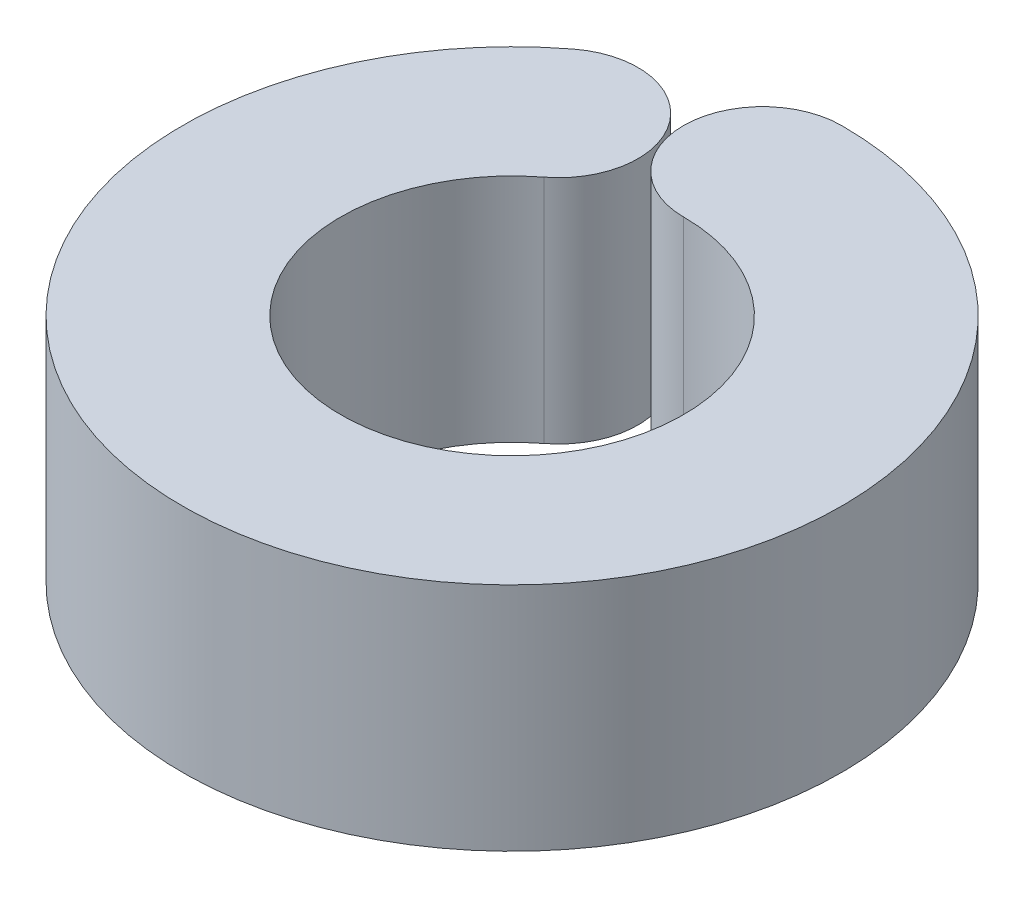
ISO-10303-21;
HEADER;
FILE_DESCRIPTION(('STEP AP214'),'2;1');
FILE_NAME('part.step','',(''),(''),'','','');
FILE_SCHEMA(('AUTOMOTIVE_DESIGN { 1 0 10303 214 1 1 1 1 }'));
ENDSEC;
DATA;
#1=APPLICATION_CONTEXT('core data for automotive mechanical design processes');
#2=APPLICATION_PROTOCOL_DEFINITION('international standard','automotive_design',2000,#1);
#3=PRODUCT_CONTEXT('',#1,'mechanical');
#4=PRODUCT('Part','Part','',(#3));
#5=PRODUCT_RELATED_PRODUCT_CATEGORY('part','',(#4));
#6=PRODUCT_DEFINITION_FORMATION('','',#4);
#7=PRODUCT_DEFINITION_CONTEXT('part definition',#1,'design');
#8=PRODUCT_DEFINITION('design','',#6,#7);
#9=PRODUCT_DEFINITION_SHAPE('','',#8);
#10=(LENGTH_UNIT() NAMED_UNIT(*) SI_UNIT(.MILLI.,.METRE.));
#11=(NAMED_UNIT(*) PLANE_ANGLE_UNIT() SI_UNIT($,.RADIAN.));
#12=(NAMED_UNIT(*) SI_UNIT($,.STERADIAN.) SOLID_ANGLE_UNIT());
#13=UNCERTAINTY_MEASURE_WITH_UNIT(LENGTH_MEASURE(1.E-05),#10,'distance_accuracy_value','');
#14=(GEOMETRIC_REPRESENTATION_CONTEXT(3) GLOBAL_UNCERTAINTY_ASSIGNED_CONTEXT((#13)) GLOBAL_UNIT_ASSIGNED_CONTEXT((#10,
#11,#12)) REPRESENTATION_CONTEXT('',''));
#15=CARTESIAN_POINT('',(0.,0.,0.));
#16=DIRECTION('',(0.,0.,1.));
#17=DIRECTION('',(1.,0.,0.));
#18=AXIS2_PLACEMENT_3D('',#15,#16,#17);
#19=CARTESIAN_POINT('',(0.,3.5,0.));
#20=DIRECTION('',(0.,-1.,0.));
#21=DIRECTION('',(0.,0.,-1.));
#22=AXIS2_PLACEMENT_3D('',#19,#20,#21);
#23=CYLINDRICAL_SURFACE('',#22,2.6);
#24=CARTESIAN_POINT('',(0.,0.,0.));
#25=DIRECTION('',(0.,1.,0.));
#26=DIRECTION('',(0.,0.,1.));
#27=AXIS2_PLACEMENT_3D('',#24,#25,#26);
#28=CIRCLE('',#27,2.6);
#29=CARTESIAN_POINT('',(0.,0.,-2.6));
#30=VERTEX_POINT('',#29);
#31=CARTESIAN_POINT('',(-1.57975097216721,0.,-2.06503919234884));
#32=VERTEX_POINT('',#31);
#33=EDGE_CURVE('E109',#30,#32,#28,.F.);
#34=ORIENTED_EDGE('',*,*,#33,.T.);
#35=DIRECTION('',(0.,-1.,0.));
#36=VECTOR('',#35,1.);
#37=CARTESIAN_POINT('',(-1.57975097216721,3.5,-2.06503919234884));
#38=LINE('',#37,#36);
#39=CARTESIAN_POINT('',(-1.57975097216721,3.5,-2.06503919234884));
#40=VERTEX_POINT('',#39);
#41=EDGE_CURVE('E11',#40,#32,#38,.T.);
#42=ORIENTED_EDGE('',*,*,#41,.F.);
#43=CARTESIAN_POINT('',(0.,3.5,0.));
#44=DIRECTION('',(0.,1.,0.));
#45=DIRECTION('',(0.,0.,1.));
#46=AXIS2_PLACEMENT_3D('',#43,#44,#45);
#47=CIRCLE('',#46,2.6);
#48=CARTESIAN_POINT('',(0.,3.5,-2.6));
#49=VERTEX_POINT('',#48);
#50=EDGE_CURVE('E91',#49,#40,#47,.F.);
#51=ORIENTED_EDGE('',*,*,#50,.F.);
#52=DIRECTION('',(0.,-1.,0.));
#53=VECTOR('',#52,1.);
#54=CARTESIAN_POINT('',(0.,3.5,-2.6));
#55=LINE('',#54,#53);
#56=EDGE_CURVE('E58',#49,#30,#55,.T.);
#57=ORIENTED_EDGE('',*,*,#56,.T.);
#58=EDGE_LOOP('',(#34,#42,#51,#57));
#59=FACE_BOUND('',#58,.T.);
#60=ADVANCED_FACE('F41',(#59),#23,.F.);
#61=CARTESIAN_POINT('',(-2.30886680547515,3.5,-3.01813420420216));
#62=DIRECTION('',(0.,-1.,0.));
#63=DIRECTION('',(0.,0.,-1.));
#64=AXIS2_PLACEMENT_3D('',#61,#62,#63);
#65=CYLINDRICAL_SURFACE('',#64,1.2);
#66=CARTESIAN_POINT('',(-2.30886680547515,0.,-3.01813420420216));
#67=DIRECTION('',(0.,1.,0.));
#68=DIRECTION('',(0.,0.,1.));
#69=AXIS2_PLACEMENT_3D('',#66,#67,#68);
#70=CIRCLE('',#69,1.2);
#71=CARTESIAN_POINT('',(-3.03798263878309,0.,-3.97122921605547));
#72=VERTEX_POINT('',#71);
#73=EDGE_CURVE('E97',#32,#72,#70,.T.);
#74=ORIENTED_EDGE('',*,*,#73,.T.);
#75=DIRECTION('',(0.,-1.,0.));
#76=VECTOR('',#75,1.);
#77=CARTESIAN_POINT('',(-3.03798263878309,3.5,-3.97122921605547));
#78=LINE('',#77,#76);
#79=CARTESIAN_POINT('',(-3.03798263878309,3.5,-3.97122921605547));
#80=VERTEX_POINT('',#79);
#81=EDGE_CURVE('E50',#80,#72,#78,.T.);
#82=ORIENTED_EDGE('',*,*,#81,.F.);
#83=CARTESIAN_POINT('',(-2.30886680547515,3.5,-3.01813420420216));
#84=DIRECTION('',(0.,1.,0.));
#85=DIRECTION('',(0.,0.,1.));
#86=AXIS2_PLACEMENT_3D('',#83,#84,#85);
#87=CIRCLE('',#86,1.2);
#88=EDGE_CURVE('E83',#40,#80,#87,.T.);
#89=ORIENTED_EDGE('',*,*,#88,.F.);
#90=ORIENTED_EDGE('',*,*,#41,.T.);
#91=EDGE_LOOP('',(#74,#82,#89,#90));
#92=FACE_BOUND('',#91,.T.);
#93=ADVANCED_FACE('F96',(#92),#65,.T.);
#94=CARTESIAN_POINT('',(0.,3.5,0.));
#95=DIRECTION('',(0.,-1.,0.));
#96=DIRECTION('',(0.,0.,-1.));
#97=AXIS2_PLACEMENT_3D('',#94,#95,#96);
#98=CYLINDRICAL_SURFACE('',#97,5.);
#99=CARTESIAN_POINT('',(0.,0.,0.));
#100=DIRECTION('',(0.,1.,0.));
#101=DIRECTION('',(0.,0.,1.));
#102=AXIS2_PLACEMENT_3D('',#99,#100,#101);
#103=CIRCLE('',#102,5.);
#104=CARTESIAN_POINT('',(0.,0.,-5.));
#105=VERTEX_POINT('',#104);
#106=EDGE_CURVE('E114',#105,#72,#103,.F.);
#107=ORIENTED_EDGE('',*,*,#106,.F.);
#108=DIRECTION('',(0.,-1.,0.));
#109=VECTOR('',#108,1.);
#110=CARTESIAN_POINT('',(0.,3.5,-5.));
#111=LINE('',#110,#109);
#112=CARTESIAN_POINT('',(0.,3.5,-5.));
#113=VERTEX_POINT('',#112);
#114=EDGE_CURVE('E72',#113,#105,#111,.T.);
#115=ORIENTED_EDGE('',*,*,#114,.F.);
#116=CARTESIAN_POINT('',(0.,3.5,0.));
#117=DIRECTION('',(0.,1.,0.));
#118=DIRECTION('',(0.,0.,1.));
#119=AXIS2_PLACEMENT_3D('',#116,#117,#118);
#120=CIRCLE('',#119,5.);
#121=EDGE_CURVE('E90',#113,#80,#120,.F.);
#122=ORIENTED_EDGE('',*,*,#121,.T.);
#123=ORIENTED_EDGE('',*,*,#81,.T.);
#124=EDGE_LOOP('',(#107,#115,#122,#123));
#125=FACE_BOUND('',#124,.T.);
#126=ADVANCED_FACE('F101',(#125),#98,.T.);
#127=CARTESIAN_POINT('',(0.,3.5,-3.8));
#128=DIRECTION('',(0.,-1.,0.));
#129=DIRECTION('',(0.,0.,-1.));
#130=AXIS2_PLACEMENT_3D('',#127,#128,#129);
#131=CYLINDRICAL_SURFACE('',#130,1.2);
#132=CARTESIAN_POINT('',(0.,0.,-3.8));
#133=DIRECTION('',(0.,1.,0.));
#134=DIRECTION('',(0.,0.,1.));
#135=AXIS2_PLACEMENT_3D('',#132,#133,#134);
#136=CIRCLE('',#135,1.2);
#137=EDGE_CURVE('E117',#30,#105,#136,.F.);
#138=ORIENTED_EDGE('',*,*,#137,.F.);
#139=ORIENTED_EDGE('',*,*,#56,.F.);
#140=CARTESIAN_POINT('',(0.,3.5,-3.8));
#141=DIRECTION('',(0.,1.,0.));
#142=DIRECTION('',(0.,0.,1.));
#143=AXIS2_PLACEMENT_3D('',#140,#141,#142);
#144=CIRCLE('',#143,1.2);
#145=EDGE_CURVE('E103',#49,#113,#144,.F.);
#146=ORIENTED_EDGE('',*,*,#145,.T.);
#147=ORIENTED_EDGE('',*,*,#114,.T.);
#148=EDGE_LOOP('',(#138,#139,#146,#147));
#149=FACE_BOUND('',#148,.T.);
#150=ADVANCED_FACE('F127',(#149),#131,.T.);
#151=CARTESIAN_POINT('',(0.,3.5,0.));
#152=DIRECTION('',(0.,1.,0.));
#153=DIRECTION('',(0.,0.,1.));
#154=AXIS2_PLACEMENT_3D('',#151,#152,#153);
#155=PLANE('',#154);
#156=ORIENTED_EDGE('',*,*,#50,.T.);
#157=ORIENTED_EDGE('',*,*,#88,.T.);
#158=ORIENTED_EDGE('',*,*,#121,.F.);
#159=ORIENTED_EDGE('',*,*,#145,.F.);
#160=EDGE_LOOP('',(#156,#157,#158,#159));
#161=FACE_BOUND('',#160,.T.);
#162=ADVANCED_FACE('F87',(#161),#155,.T.);
#163=CARTESIAN_POINT('',(0.,0.,0.));
#164=DIRECTION('',(0.,1.,0.));
#165=DIRECTION('',(0.,0.,1.));
#166=AXIS2_PLACEMENT_3D('',#163,#164,#165);
#167=PLANE('',#166);
#168=ORIENTED_EDGE('',*,*,#33,.F.);
#169=ORIENTED_EDGE('',*,*,#137,.T.);
#170=ORIENTED_EDGE('',*,*,#106,.T.);
#171=ORIENTED_EDGE('',*,*,#73,.F.);
#172=EDGE_LOOP('',(#168,#169,#170,#171));
#173=FACE_BOUND('',#172,.T.);
#174=ADVANCED_FACE('F126',(#173),#167,.F.);
#175=CLOSED_SHELL('',(#60,#93,#126,#150,#162,#174));
#176=MANIFOLD_SOLID_BREP('B2',#175);
#177=ADVANCED_BREP_SHAPE_REPRESENTATION('',(#18,#176),#14);
#178=SHAPE_DEFINITION_REPRESENTATION(#9,#177);
ENDSEC;
END-ISO-10303-21;
